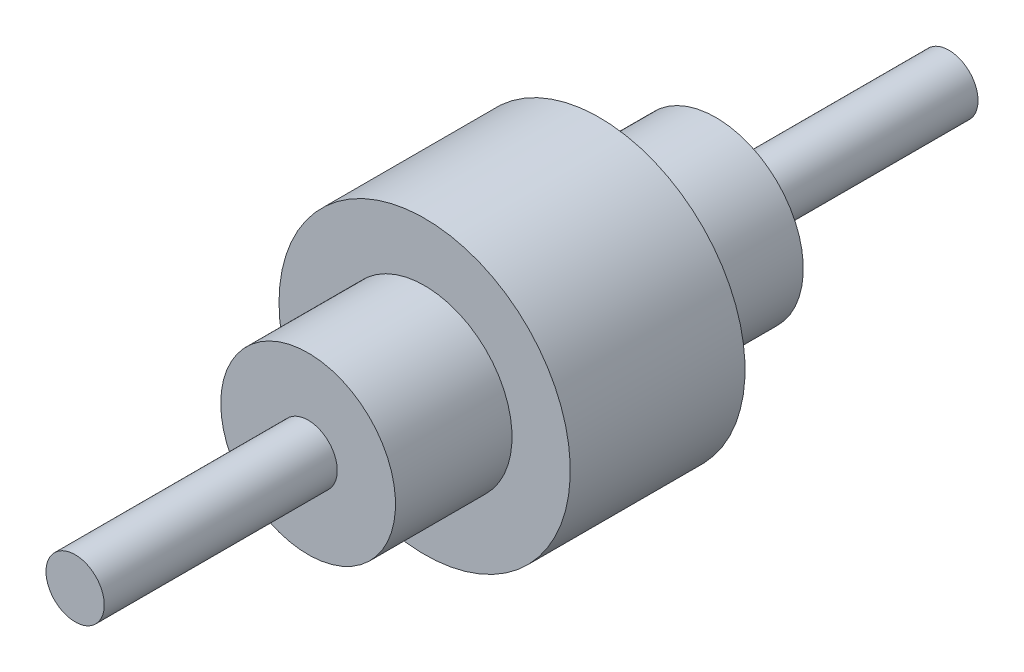
ISO-10303-21;
HEADER;
FILE_DESCRIPTION(('STEP AP214'),'2;1');
FILE_NAME('part.step','',(''),(''),'','','');
FILE_SCHEMA(('AUTOMOTIVE_DESIGN { 1 0 10303 214 1 1 1 1 }'));
ENDSEC;
DATA;
#1=APPLICATION_CONTEXT('core data for automotive mechanical design processes');
#2=APPLICATION_PROTOCOL_DEFINITION('international standard','automotive_design',2000,#1);
#3=PRODUCT_CONTEXT('',#1,'mechanical');
#4=PRODUCT('Part','Part','',(#3));
#5=PRODUCT_RELATED_PRODUCT_CATEGORY('part','',(#4));
#6=PRODUCT_DEFINITION_FORMATION('','',#4);
#7=PRODUCT_DEFINITION_CONTEXT('part definition',#1,'design');
#8=PRODUCT_DEFINITION('design','',#6,#7);
#9=PRODUCT_DEFINITION_SHAPE('','',#8);
#10=(LENGTH_UNIT() NAMED_UNIT(*) SI_UNIT(.MILLI.,.METRE.));
#11=(NAMED_UNIT(*) PLANE_ANGLE_UNIT() SI_UNIT($,.RADIAN.));
#12=(NAMED_UNIT(*) SI_UNIT($,.STERADIAN.) SOLID_ANGLE_UNIT());
#13=UNCERTAINTY_MEASURE_WITH_UNIT(LENGTH_MEASURE(1.E-05),#10,'distance_accuracy_value','');
#14=(GEOMETRIC_REPRESENTATION_CONTEXT(3) GLOBAL_UNCERTAINTY_ASSIGNED_CONTEXT((#13)) GLOBAL_UNIT_ASSIGNED_CONTEXT((#10,
#11,#12)) REPRESENTATION_CONTEXT('',''));
#15=CARTESIAN_POINT('',(0.,0.,0.));
#16=DIRECTION('',(0.,0.,1.));
#17=DIRECTION('',(1.,0.,0.));
#18=AXIS2_PLACEMENT_3D('',#15,#16,#17);
#19=CARTESIAN_POINT('',(0.,9.99999999999999,70.));
#20=DIRECTION('',(0.,0.,1.));
#21=DIRECTION('',(1.,0.,0.));
#22=AXIS2_PLACEMENT_3D('',#19,#20,#21);
#23=PLANE('',#22);
#24=CARTESIAN_POINT('',(0.,0.,70.));
#25=DIRECTION('',(0.,0.,-1.));
#26=DIRECTION('',(-1.,0.,0.));
#27=AXIS2_PLACEMENT_3D('',#24,#25,#26);
#28=CIRCLE('',#27,10.);
#29=CARTESIAN_POINT('',(-10.,0.,70.));
#30=VERTEX_POINT('',#29);
#31=EDGE_CURVE('E64',#30,#30,#28,.T.);
#32=ORIENTED_EDGE('',*,*,#31,.T.);
#33=EDGE_LOOP('',(#32));
#34=FACE_BOUND('',#33,.T.);
#35=CARTESIAN_POINT('',(0.,0.,70.));
#36=DIRECTION('',(0.,0.,-1.));
#37=DIRECTION('',(-1.,0.,0.));
#38=AXIS2_PLACEMENT_3D('',#35,#36,#37);
#39=CIRCLE('',#38,30.);
#40=CARTESIAN_POINT('',(-30.,0.,70.));
#41=VERTEX_POINT('',#40);
#42=EDGE_CURVE('E10',#41,#41,#39,.T.);
#43=ORIENTED_EDGE('',*,*,#42,.F.);
#44=EDGE_LOOP('',(#43));
#45=FACE_BOUND('',#44,.T.);
#46=ADVANCED_FACE('F30',(#34,#45),#23,.T.);
#47=CARTESIAN_POINT('',(0.,0.,-150.));
#48=DIRECTION('',(0.,0.,-1.));
#49=DIRECTION('',(-1.,0.,0.));
#50=AXIS2_PLACEMENT_3D('',#47,#48,#49);
#51=CYLINDRICAL_SURFACE('',#50,30.);
#52=ORIENTED_EDGE('',*,*,#42,.T.);
#53=EDGE_LOOP('',(#52));
#54=FACE_BOUND('',#53,.T.);
#55=CARTESIAN_POINT('',(0.,0.,30.));
#56=DIRECTION('',(0.,0.,-1.));
#57=DIRECTION('',(-1.,0.,0.));
#58=AXIS2_PLACEMENT_3D('',#55,#56,#57);
#59=CIRCLE('',#58,30.);
#60=CARTESIAN_POINT('',(-30.,0.,30.));
#61=VERTEX_POINT('',#60);
#62=EDGE_CURVE('E36',#61,#61,#59,.T.);
#63=ORIENTED_EDGE('',*,*,#62,.F.);
#64=EDGE_LOOP('',(#63));
#65=FACE_BOUND('',#64,.T.);
#66=ADVANCED_FACE('F82',(#54,#65),#51,.T.);
#67=CARTESIAN_POINT('',(0.,30.,30.));
#68=DIRECTION('',(0.,0.,1.));
#69=DIRECTION('',(1.,0.,0.));
#70=AXIS2_PLACEMENT_3D('',#67,#68,#69);
#71=PLANE('',#70);
#72=ORIENTED_EDGE('',*,*,#62,.T.);
#73=EDGE_LOOP('',(#72));
#74=FACE_BOUND('',#73,.T.);
#75=CARTESIAN_POINT('',(0.,0.,30.));
#76=DIRECTION('',(0.,0.,-1.));
#77=DIRECTION('',(-1.,0.,0.));
#78=AXIS2_PLACEMENT_3D('',#75,#76,#77);
#79=CIRCLE('',#78,50.);
#80=CARTESIAN_POINT('',(-50.,0.,30.));
#81=VERTEX_POINT('',#80);
#82=EDGE_CURVE('E40',#81,#81,#79,.T.);
#83=ORIENTED_EDGE('',*,*,#82,.F.);
#84=EDGE_LOOP('',(#83));
#85=FACE_BOUND('',#84,.T.);
#86=ADVANCED_FACE('F86',(#74,#85),#71,.T.);
#87=CARTESIAN_POINT('',(0.,0.,-150.));
#88=DIRECTION('',(0.,0.,-1.));
#89=DIRECTION('',(-1.,0.,0.));
#90=AXIS2_PLACEMENT_3D('',#87,#88,#89);
#91=CYLINDRICAL_SURFACE('',#90,50.);
#92=ORIENTED_EDGE('',*,*,#82,.T.);
#93=EDGE_LOOP('',(#92));
#94=FACE_BOUND('',#93,.T.);
#95=CARTESIAN_POINT('',(0.,0.,-30.));
#96=DIRECTION('',(0.,0.,-1.));
#97=DIRECTION('',(-1.,0.,0.));
#98=AXIS2_PLACEMENT_3D('',#95,#96,#97);
#99=CIRCLE('',#98,50.);
#100=CARTESIAN_POINT('',(-50.,0.,-30.));
#101=VERTEX_POINT('',#100);
#102=EDGE_CURVE('E44',#101,#101,#99,.T.);
#103=ORIENTED_EDGE('',*,*,#102,.F.);
#104=EDGE_LOOP('',(#103));
#105=FACE_BOUND('',#104,.T.);
#106=ADVANCED_FACE('F90',(#94,#105),#91,.T.);
#107=CARTESIAN_POINT('',(0.,50.,-30.));
#108=DIRECTION('',(0.,0.,-1.));
#109=DIRECTION('',(-1.,0.,0.));
#110=AXIS2_PLACEMENT_3D('',#107,#108,#109);
#111=PLANE('',#110);
#112=ORIENTED_EDGE('',*,*,#102,.T.);
#113=EDGE_LOOP('',(#112));
#114=FACE_BOUND('',#113,.T.);
#115=CARTESIAN_POINT('',(0.,0.,-30.));
#116=DIRECTION('',(0.,0.,-1.));
#117=DIRECTION('',(-1.,0.,0.));
#118=AXIS2_PLACEMENT_3D('',#115,#116,#117);
#119=CIRCLE('',#118,30.);
#120=CARTESIAN_POINT('',(-30.,0.,-30.));
#121=VERTEX_POINT('',#120);
#122=EDGE_CURVE('E49',#121,#121,#119,.T.);
#123=ORIENTED_EDGE('',*,*,#122,.F.);
#124=EDGE_LOOP('',(#123));
#125=FACE_BOUND('',#124,.T.);
#126=ADVANCED_FACE('F96',(#114,#125),#111,.T.);
#127=CARTESIAN_POINT('',(0.,0.,-150.));
#128=DIRECTION('',(0.,0.,-1.));
#129=DIRECTION('',(-1.,0.,0.));
#130=AXIS2_PLACEMENT_3D('',#127,#128,#129);
#131=CYLINDRICAL_SURFACE('',#130,30.);
#132=ORIENTED_EDGE('',*,*,#122,.T.);
#133=EDGE_LOOP('',(#132));
#134=FACE_BOUND('',#133,.T.);
#135=CARTESIAN_POINT('',(0.,0.,-70.));
#136=DIRECTION('',(0.,0.,-1.));
#137=DIRECTION('',(-1.,0.,0.));
#138=AXIS2_PLACEMENT_3D('',#135,#136,#137);
#139=CIRCLE('',#138,30.);
#140=CARTESIAN_POINT('',(-30.,0.,-70.));
#141=VERTEX_POINT('',#140);
#142=EDGE_CURVE('E52',#141,#141,#139,.T.);
#143=ORIENTED_EDGE('',*,*,#142,.F.);
#144=EDGE_LOOP('',(#143));
#145=FACE_BOUND('',#144,.T.);
#146=ADVANCED_FACE('F100',(#134,#145),#131,.T.);
#147=CARTESIAN_POINT('',(0.,30.,-70.));
#148=DIRECTION('',(0.,0.,-1.));
#149=DIRECTION('',(-1.,0.,0.));
#150=AXIS2_PLACEMENT_3D('',#147,#148,#149);
#151=PLANE('',#150);
#152=ORIENTED_EDGE('',*,*,#142,.T.);
#153=EDGE_LOOP('',(#152));
#154=FACE_BOUND('',#153,.T.);
#155=CARTESIAN_POINT('',(0.,0.,-70.));
#156=DIRECTION('',(0.,0.,-1.));
#157=DIRECTION('',(-1.,0.,0.));
#158=AXIS2_PLACEMENT_3D('',#155,#156,#157);
#159=CIRCLE('',#158,10.);
#160=CARTESIAN_POINT('',(-10.,0.,-70.));
#161=VERTEX_POINT('',#160);
#162=EDGE_CURVE('E55',#161,#161,#159,.T.);
#163=ORIENTED_EDGE('',*,*,#162,.F.);
#164=EDGE_LOOP('',(#163));
#165=FACE_BOUND('',#164,.T.);
#166=ADVANCED_FACE('F104',(#154,#165),#151,.T.);
#167=CARTESIAN_POINT('',(0.,0.,-150.));
#168=DIRECTION('',(0.,0.,-1.));
#169=DIRECTION('',(-1.,0.,0.));
#170=AXIS2_PLACEMENT_3D('',#167,#168,#169);
#171=CYLINDRICAL_SURFACE('',#170,10.);
#172=ORIENTED_EDGE('',*,*,#162,.T.);
#173=EDGE_LOOP('',(#172));
#174=FACE_BOUND('',#173,.T.);
#175=CARTESIAN_POINT('',(0.,0.,-150.));
#176=DIRECTION('',(0.,0.,-1.));
#177=DIRECTION('',(-1.,0.,0.));
#178=AXIS2_PLACEMENT_3D('',#175,#176,#177);
#179=CIRCLE('',#178,10.);
#180=CARTESIAN_POINT('',(-10.,0.,-150.));
#181=VERTEX_POINT('',#180);
#182=EDGE_CURVE('E58',#181,#181,#179,.T.);
#183=ORIENTED_EDGE('',*,*,#182,.F.);
#184=EDGE_LOOP('',(#183));
#185=FACE_BOUND('',#184,.T.);
#186=ADVANCED_FACE('F108',(#174,#185),#171,.T.);
#187=CARTESIAN_POINT('',(0.,9.99999999999999,-150.));
#188=DIRECTION('',(0.,0.,-1.));
#189=DIRECTION('',(-1.,0.,0.));
#190=AXIS2_PLACEMENT_3D('',#187,#188,#189);
#191=PLANE('',#190);
#192=ORIENTED_EDGE('',*,*,#182,.T.);
#193=EDGE_LOOP('',(#192));
#194=FACE_BOUND('',#193,.T.);
#195=ADVANCED_FACE('F78',(#194),#191,.T.);
#196=CARTESIAN_POINT('',(0.,0.,150.));
#197=DIRECTION('',(0.,0.,1.));
#198=DIRECTION('',(1.,0.,0.));
#199=AXIS2_PLACEMENT_3D('',#196,#197,#198);
#200=PLANE('',#199);
#201=CARTESIAN_POINT('',(0.,0.,150.));
#202=DIRECTION('',(0.,0.,-1.));
#203=DIRECTION('',(-1.,0.,0.));
#204=AXIS2_PLACEMENT_3D('',#201,#202,#203);
#205=CIRCLE('',#204,10.);
#206=CARTESIAN_POINT('',(-10.,0.,150.));
#207=VERTEX_POINT('',#206);
#208=EDGE_CURVE('E61',#207,#207,#205,.T.);
#209=ORIENTED_EDGE('',*,*,#208,.F.);
#210=EDGE_LOOP('',(#209));
#211=FACE_BOUND('',#210,.T.);
#212=ADVANCED_FACE('F72',(#211),#200,.T.);
#213=CARTESIAN_POINT('',(0.,0.,-150.));
#214=DIRECTION('',(0.,0.,-1.));
#215=DIRECTION('',(-1.,0.,0.));
#216=AXIS2_PLACEMENT_3D('',#213,#214,#215);
#217=CYLINDRICAL_SURFACE('',#216,10.);
#218=ORIENTED_EDGE('',*,*,#208,.T.);
#219=EDGE_LOOP('',(#218));
#220=FACE_BOUND('',#219,.T.);
#221=ORIENTED_EDGE('',*,*,#31,.F.);
#222=EDGE_LOOP('',(#221));
#223=FACE_BOUND('',#222,.T.);
#224=ADVANCED_FACE('F70',(#220,#223),#217,.T.);
#225=CLOSED_SHELL('',(#46,#66,#86,#106,#126,#146,#166,#186,#195,#212,#224));
#226=MANIFOLD_SOLID_BREP('B2',#225);
#227=ADVANCED_BREP_SHAPE_REPRESENTATION('',(#18,#226),#14);
#228=SHAPE_DEFINITION_REPRESENTATION(#9,#227);
ENDSEC;
END-ISO-10303-21;
